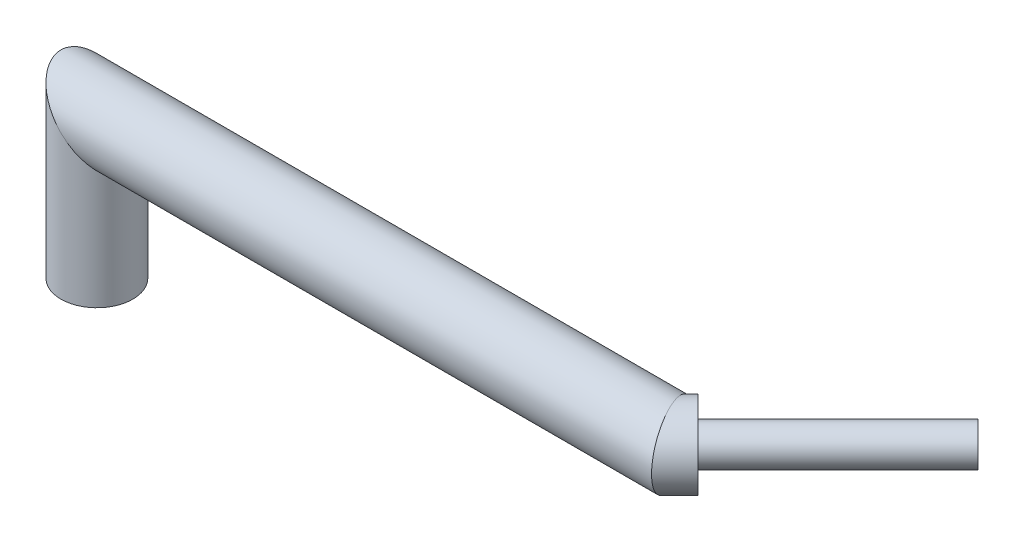
ISO-10303-21;
HEADER;
FILE_DESCRIPTION(('STEP AP214'),'2;1');
FILE_NAME('part.step','',(''),(''),'','','');
FILE_SCHEMA(('AUTOMOTIVE_DESIGN { 1 0 10303 214 1 1 1 1 }'));
ENDSEC;
DATA;
#1=APPLICATION_CONTEXT('core data for automotive mechanical design processes');
#2=APPLICATION_PROTOCOL_DEFINITION('international standard','automotive_design',2000,#1);
#3=PRODUCT_CONTEXT('',#1,'mechanical');
#4=PRODUCT('Part','Part','',(#3));
#5=PRODUCT_RELATED_PRODUCT_CATEGORY('part','',(#4));
#6=PRODUCT_DEFINITION_FORMATION('','',#4);
#7=PRODUCT_DEFINITION_CONTEXT('part definition',#1,'design');
#8=PRODUCT_DEFINITION('design','',#6,#7);
#9=PRODUCT_DEFINITION_SHAPE('','',#8);
#10=(LENGTH_UNIT() NAMED_UNIT(*) SI_UNIT(.MILLI.,.METRE.));
#11=(NAMED_UNIT(*) PLANE_ANGLE_UNIT() SI_UNIT($,.RADIAN.));
#12=(NAMED_UNIT(*) SI_UNIT($,.STERADIAN.) SOLID_ANGLE_UNIT());
#13=UNCERTAINTY_MEASURE_WITH_UNIT(LENGTH_MEASURE(1.E-05),#10,'distance_accuracy_value','');
#14=(GEOMETRIC_REPRESENTATION_CONTEXT(3) GLOBAL_UNCERTAINTY_ASSIGNED_CONTEXT((#13)) GLOBAL_UNIT_ASSIGNED_CONTEXT((#10,
#11,#12)) REPRESENTATION_CONTEXT('',''));
#15=CARTESIAN_POINT('',(0.,0.,0.));
#16=DIRECTION('',(0.,0.,1.));
#17=DIRECTION('',(1.,0.,0.));
#18=AXIS2_PLACEMENT_3D('',#15,#16,#17);
#19=CARTESIAN_POINT('',(156.707463914933,40.,3.29253608506665));
#20=DIRECTION('',(0.707106781186546,0.,-0.707106781186549));
#21=DIRECTION('',(-0.707106781186549,0.,-0.707106781186546));
#22=AXIS2_PLACEMENT_3D('',#19,#20,#21);
#23=CYLINDRICAL_SURFACE('',#22,10.);
#24=CARTESIAN_POINT('',(160.,40.,0.));
#25=DIRECTION('',(0.923879532511286,0.,-0.382683432365091));
#26=DIRECTION('',(0.382683432365091,0.,0.923879532511286));
#27=AXIS2_PLACEMENT_3D('',#24,#25,#26);
#28=ELLIPSE('',#27,10.823922002924,10.);
#29=CARTESIAN_POINT('',(164.142135623731,40.,9.99999999999999));
#30=VERTEX_POINT('',#29);
#31=EDGE_CURVE('E43',#30,#30,#28,.T.);
#32=ORIENTED_EDGE('',*,*,#31,.T.);
#33=EDGE_LOOP('',(#32));
#34=FACE_BOUND('',#33,.T.);
#35=CARTESIAN_POINT('',(163.535533905933,40.,-3.53553390593275));
#36=DIRECTION('',(0.707106781186546,0.,-0.707106781186549));
#37=DIRECTION('',(-0.707106781186549,0.,-0.707106781186546));
#38=AXIS2_PLACEMENT_3D('',#35,#36,#37);
#39=CIRCLE('',#38,10.);
#40=CARTESIAN_POINT('',(156.464466094067,40.,-10.6066017177982));
#41=VERTEX_POINT('',#40);
#42=EDGE_CURVE('E103',#41,#41,#39,.T.);
#43=ORIENTED_EDGE('',*,*,#42,.F.);
#44=EDGE_LOOP('',(#43));
#45=FACE_BOUND('',#44,.T.);
#46=ADVANCED_FACE('F39',(#34,#45),#23,.T.);
#47=CARTESIAN_POINT('',(0.,0.,0.));
#48=DIRECTION('',(0.,-1.,0.));
#49=DIRECTION('',(0.,0.,1.));
#50=AXIS2_PLACEMENT_3D('',#47,#48,#49);
#51=PLANE('',#50);
#52=CARTESIAN_POINT('',(0.,0.,0.));
#53=DIRECTION('',(0.,-1.,0.));
#54=DIRECTION('',(0.,0.,-1.));
#55=AXIS2_PLACEMENT_3D('',#52,#53,#54);
#56=CIRCLE('',#55,8.00000000000001);
#57=CARTESIAN_POINT('',(0.,0.,-8.00000000000002));
#58=VERTEX_POINT('',#57);
#59=EDGE_CURVE('E85',#58,#58,#56,.T.);
#60=ORIENTED_EDGE('',*,*,#59,.F.);
#61=EDGE_LOOP('',(#60));
#62=FACE_BOUND('',#61,.T.);
#63=CARTESIAN_POINT('',(0.,0.,0.));
#64=DIRECTION('',(0.,-1.,0.));
#65=DIRECTION('',(0.,0.,1.));
#66=AXIS2_PLACEMENT_3D('',#63,#64,#65);
#67=CIRCLE('',#66,10.);
#68=CARTESIAN_POINT('',(0.,0.,9.99999999999999));
#69=VERTEX_POINT('',#68);
#70=EDGE_CURVE('E48',#69,#69,#67,.T.);
#71=ORIENTED_EDGE('',*,*,#70,.T.);
#72=EDGE_LOOP('',(#71));
#73=FACE_BOUND('',#72,.T.);
#74=ADVANCED_FACE('F112',(#62,#73),#51,.T.);
#75=CARTESIAN_POINT('',(-22.1,40.,0.));
#76=DIRECTION('',(1.,0.,0.));
#77=DIRECTION('',(0.,0.,-1.));
#78=AXIS2_PLACEMENT_3D('',#75,#76,#77);
#79=CYLINDRICAL_SURFACE('',#78,10.);
#80=CARTESIAN_POINT('',(0.,40.,0.));
#81=DIRECTION('',(0.707106781186548,0.707106781186548,0.));
#82=DIRECTION('',(-0.707106781186548,0.707106781186548,0.));
#83=AXIS2_PLACEMENT_3D('',#80,#81,#82);
#84=ELLIPSE('',#83,14.142135623731,10.);
#85=CARTESIAN_POINT('',(-10.,50.,0.));
#86=VERTEX_POINT('',#85);
#87=EDGE_CURVE('E12',#86,#86,#84,.T.);
#88=ORIENTED_EDGE('',*,*,#87,.T.);
#89=EDGE_LOOP('',(#88));
#90=FACE_BOUND('',#89,.T.);
#91=ORIENTED_EDGE('',*,*,#31,.F.);
#92=EDGE_LOOP('',(#91));
#93=FACE_BOUND('',#92,.T.);
#94=ADVANCED_FACE('F136',(#90,#93),#79,.T.);
#95=CARTESIAN_POINT('',(0.,0.,0.));
#96=DIRECTION('',(0.,1.,0.));
#97=DIRECTION('',(0.,0.,1.));
#98=AXIS2_PLACEMENT_3D('',#95,#96,#97);
#99=CYLINDRICAL_SURFACE('',#98,10.);
#100=ORIENTED_EDGE('',*,*,#70,.F.);
#101=EDGE_LOOP('',(#100));
#102=FACE_BOUND('',#101,.T.);
#103=ORIENTED_EDGE('',*,*,#87,.F.);
#104=EDGE_LOOP('',(#103));
#105=FACE_BOUND('',#104,.T.);
#106=ADVANCED_FACE('F114',(#102,#105),#99,.T.);
#107=CARTESIAN_POINT('',(163.535533905933,40.,-3.53553390593274));
#108=DIRECTION('',(0.707106781186546,0.,-0.707106781186549));
#109=DIRECTION('',(-0.707106781186549,0.,-0.707106781186546));
#110=AXIS2_PLACEMENT_3D('',#107,#108,#109);
#111=CYLINDRICAL_SURFACE('',#110,4.99999999999999);
#112=CARTESIAN_POINT('',(163.535533905933,40.,-3.53553390593274));
#113=DIRECTION('',(0.707106781186546,0.,-0.707106781186549));
#114=DIRECTION('',(-0.707106781186549,0.,-0.707106781186546));
#115=AXIS2_PLACEMENT_3D('',#112,#113,#114);
#116=CIRCLE('',#115,4.99999999999999);
#117=CARTESIAN_POINT('',(160.,40.,-7.07106781186546));
#118=VERTEX_POINT('',#117);
#119=EDGE_CURVE('E100',#118,#118,#116,.T.);
#120=ORIENTED_EDGE('',*,*,#119,.T.);
#121=EDGE_LOOP('',(#120));
#122=FACE_BOUND('',#121,.T.);
#123=CARTESIAN_POINT('',(202.426406871193,40.,-42.4264068711929));
#124=DIRECTION('',(0.707106781186546,0.,-0.707106781186549));
#125=DIRECTION('',(-0.707106781186549,0.,-0.707106781186546));
#126=AXIS2_PLACEMENT_3D('',#123,#124,#125);
#127=CIRCLE('',#126,4.99999999999999);
#128=CARTESIAN_POINT('',(198.89087296526,40.,-45.9619407771256));
#129=VERTEX_POINT('',#128);
#130=EDGE_CURVE('E99',#129,#129,#127,.T.);
#131=ORIENTED_EDGE('',*,*,#130,.F.);
#132=EDGE_LOOP('',(#131));
#133=FACE_BOUND('',#132,.T.);
#134=ADVANCED_FACE('F119',(#122,#133),#111,.T.);
#135=CARTESIAN_POINT('',(83.5355339059323,0.,-83.5355339059327));
#136=DIRECTION('',(0.707106781186546,0.,-0.707106781186549));
#137=DIRECTION('',(-0.707106781186549,0.,-0.707106781186546));
#138=AXIS2_PLACEMENT_3D('',#135,#136,#137);
#139=PLANE('',#138);
#140=ORIENTED_EDGE('',*,*,#119,.F.);
#141=EDGE_LOOP('',(#140));
#142=FACE_BOUND('',#141,.T.);
#143=ORIENTED_EDGE('',*,*,#42,.T.);
#144=EDGE_LOOP('',(#143));
#145=FACE_BOUND('',#144,.T.);
#146=ADVANCED_FACE('F117',(#142,#145),#139,.T.);
#147=CARTESIAN_POINT('',(202.426406871193,40.,-42.426406871193));
#148=DIRECTION('',(-0.707106781186546,0.,0.707106781186549));
#149=DIRECTION('',(0.707106781186549,0.,0.707106781186546));
#150=AXIS2_PLACEMENT_3D('',#147,#148,#149);
#151=PLANE('',#150);
#152=ORIENTED_EDGE('',*,*,#130,.T.);
#153=EDGE_LOOP('',(#152));
#154=FACE_BOUND('',#153,.T.);
#155=ADVANCED_FACE('F41',(#154),#151,.F.);
#156=CARTESIAN_POINT('',(156.707463914933,40.,3.29253608506665));
#157=DIRECTION('',(0.707106781186546,0.,-0.707106781186549));
#158=DIRECTION('',(-0.707106781186549,0.,-0.707106781186546));
#159=AXIS2_PLACEMENT_3D('',#156,#157,#158);
#160=CYLINDRICAL_SURFACE('',#159,8.00000000000001);
#161=CARTESIAN_POINT('',(160.,40.,0.));
#162=DIRECTION('',(0.923879532511286,0.,-0.382683432365091));
#163=DIRECTION('',(0.382683432365091,0.,0.923879532511286));
#164=AXIS2_PLACEMENT_3D('',#161,#162,#163);
#165=ELLIPSE('',#164,8.65913760233916,8.00000000000001);
#166=CARTESIAN_POINT('',(160.,48.,0.));
#167=VERTEX_POINT('',#166);
#168=CARTESIAN_POINT('',(157.,36.6023308169734,-7.24264068711905));
#169=VERTEX_POINT('',#168);
#170=EDGE_CURVE('E77',#167,#169,#165,.T.);
#171=ORIENTED_EDGE('',*,*,#170,.F.);
#172=CARTESIAN_POINT('',(157.,43.3976691830266,-7.24264068711904));
#173=VERTEX_POINT('',#172);
#174=EDGE_CURVE('E74',#173,#167,#165,.T.);
#175=ORIENTED_EDGE('',*,*,#174,.F.);
#176=CARTESIAN_POINT('',(162.12132034356,40.,-2.12132034355962));
#177=DIRECTION('',(0.707106781186546,0.,-0.707106781186549));
#178=DIRECTION('',(-0.707106781186549,0.,-0.707106781186546));
#179=AXIS2_PLACEMENT_3D('',#176,#177,#178);
#180=CIRCLE('',#179,8.00000000000001);
#181=EDGE_CURVE('E82',#173,#169,#180,.T.);
#182=ORIENTED_EDGE('',*,*,#181,.T.);
#183=EDGE_LOOP('',(#171,#175,#182));
#184=FACE_BOUND('',#183,.T.);
#185=ADVANCED_FACE('F84',(#184),#160,.F.);
#186=CARTESIAN_POINT('',(-22.1,40.,0.));
#187=DIRECTION('',(1.,0.,0.));
#188=DIRECTION('',(0.,0.,-1.));
#189=AXIS2_PLACEMENT_3D('',#186,#187,#188);
#190=CYLINDRICAL_SURFACE('',#189,8.00000000000001);
#191=CARTESIAN_POINT('',(0.,40.,0.));
#192=DIRECTION('',(0.707106781186547,0.707106781186547,0.));
#193=DIRECTION('',(-0.707106781186547,0.707106781186547,0.));
#194=AXIS2_PLACEMENT_3D('',#191,#192,#193);
#195=ELLIPSE('',#194,11.3137084989848,8.00000000000001);
#196=CARTESIAN_POINT('',(0.,40.,-8.00000000000002));
#197=VERTEX_POINT('',#196);
#198=EDGE_CURVE('E87',#197,#197,#195,.T.);
#199=ORIENTED_EDGE('',*,*,#198,.F.);
#200=EDGE_LOOP('',(#199));
#201=FACE_BOUND('',#200,.T.);
#202=ORIENTED_EDGE('',*,*,#170,.T.);
#203=CARTESIAN_POINT('',(164.242640687119,40.,0.));
#204=DIRECTION('',(0.707106781186546,0.,-0.707106781186549));
#205=DIRECTION('',(0.707106781186549,0.,0.707106781186546));
#206=AXIS2_PLACEMENT_3D('',#203,#204,#205);
#207=ELLIPSE('',#206,11.3137084989848,8.00000000000001);
#208=EDGE_CURVE('E78',#173,#169,#207,.F.);
#209=ORIENTED_EDGE('',*,*,#208,.F.);
#210=ORIENTED_EDGE('',*,*,#174,.T.);
#211=EDGE_LOOP('',(#202,#209,#210));
#212=FACE_BOUND('',#211,.T.);
#213=ADVANCED_FACE('F76',(#201,#212),#190,.F.);
#214=CARTESIAN_POINT('',(0.,0.,0.));
#215=DIRECTION('',(0.,1.,0.));
#216=DIRECTION('',(0.,0.,1.));
#217=AXIS2_PLACEMENT_3D('',#214,#215,#216);
#218=CYLINDRICAL_SURFACE('',#217,8.00000000000001);
#219=ORIENTED_EDGE('',*,*,#59,.T.);
#220=EDGE_LOOP('',(#219));
#221=FACE_BOUND('',#220,.T.);
#222=ORIENTED_EDGE('',*,*,#198,.T.);
#223=EDGE_LOOP('',(#222));
#224=FACE_BOUND('',#223,.T.);
#225=ADVANCED_FACE('F147',(#221,#224),#218,.F.);
#226=CARTESIAN_POINT('',(163.535533905933,40.,-3.53553390593274));
#227=DIRECTION('',(0.707106781186546,0.,-0.707106781186549));
#228=DIRECTION('',(-0.707106781186549,0.,-0.707106781186546));
#229=AXIS2_PLACEMENT_3D('',#226,#227,#228);
#230=CYLINDRICAL_SURFACE('',#229,2.99999999999999);
#231=CARTESIAN_POINT('',(162.12132034356,40.,-2.12132034355963));
#232=DIRECTION('',(0.707106781186546,0.,-0.707106781186549));
#233=DIRECTION('',(-0.707106781186549,0.,-0.707106781186546));
#234=AXIS2_PLACEMENT_3D('',#231,#232,#233);
#235=CIRCLE('',#234,2.99999999999999);
#236=CARTESIAN_POINT('',(160.,40.,-4.24264068711926));
#237=VERTEX_POINT('',#236);
#238=EDGE_CURVE('E91',#237,#237,#235,.T.);
#239=ORIENTED_EDGE('',*,*,#238,.F.);
#240=EDGE_LOOP('',(#239));
#241=FACE_BOUND('',#240,.T.);
#242=CARTESIAN_POINT('',(201.01219330882,40.,-41.0121933088199));
#243=DIRECTION('',(-0.707106781186546,0.,0.707106781186549));
#244=DIRECTION('',(0.707106781186549,0.,0.707106781186546));
#245=AXIS2_PLACEMENT_3D('',#242,#243,#244);
#246=CIRCLE('',#245,2.99999999999999);
#247=CARTESIAN_POINT('',(203.133513652379,40.,-38.8908729652602));
#248=VERTEX_POINT('',#247);
#249=EDGE_CURVE('E95',#248,#248,#246,.F.);
#250=ORIENTED_EDGE('',*,*,#249,.T.);
#251=EDGE_LOOP('',(#250));
#252=FACE_BOUND('',#251,.T.);
#253=ADVANCED_FACE('F150',(#241,#252),#230,.F.);
#254=CARTESIAN_POINT('',(82.1213203435592,0.,-82.1213203435596));
#255=DIRECTION('',(0.707106781186546,0.,-0.707106781186549));
#256=DIRECTION('',(-0.707106781186549,0.,-0.707106781186546));
#257=AXIS2_PLACEMENT_3D('',#254,#255,#256);
#258=PLANE('',#257);
#259=ORIENTED_EDGE('',*,*,#238,.T.);
#260=EDGE_LOOP('',(#259));
#261=FACE_BOUND('',#260,.T.);
#262=ORIENTED_EDGE('',*,*,#181,.F.);
#263=ORIENTED_EDGE('',*,*,#208,.T.);
#264=EDGE_LOOP('',(#262,#263));
#265=FACE_BOUND('',#264,.T.);
#266=ADVANCED_FACE('F160',(#261,#265),#258,.F.);
#267=CARTESIAN_POINT('',(201.01219330882,40.,-41.0121933088199));
#268=DIRECTION('',(-0.707106781186546,0.,0.707106781186549));
#269=DIRECTION('',(0.707106781186549,0.,0.707106781186546));
#270=AXIS2_PLACEMENT_3D('',#267,#268,#269);
#271=PLANE('',#270);
#272=ORIENTED_EDGE('',*,*,#249,.F.);
#273=EDGE_LOOP('',(#272));
#274=FACE_BOUND('',#273,.T.);
#275=ADVANCED_FACE('F131',(#274),#271,.T.);
#276=CLOSED_SHELL('',(#46,#74,#94,#106,#134,#146,#155,#185,#213,#225,#253,#266,#275));
#277=MANIFOLD_SOLID_BREP('B2',#276);
#278=ADVANCED_BREP_SHAPE_REPRESENTATION('',(#18,#277),#14);
#279=SHAPE_DEFINITION_REPRESENTATION(#9,#278);
ENDSEC;
END-ISO-10303-21;
